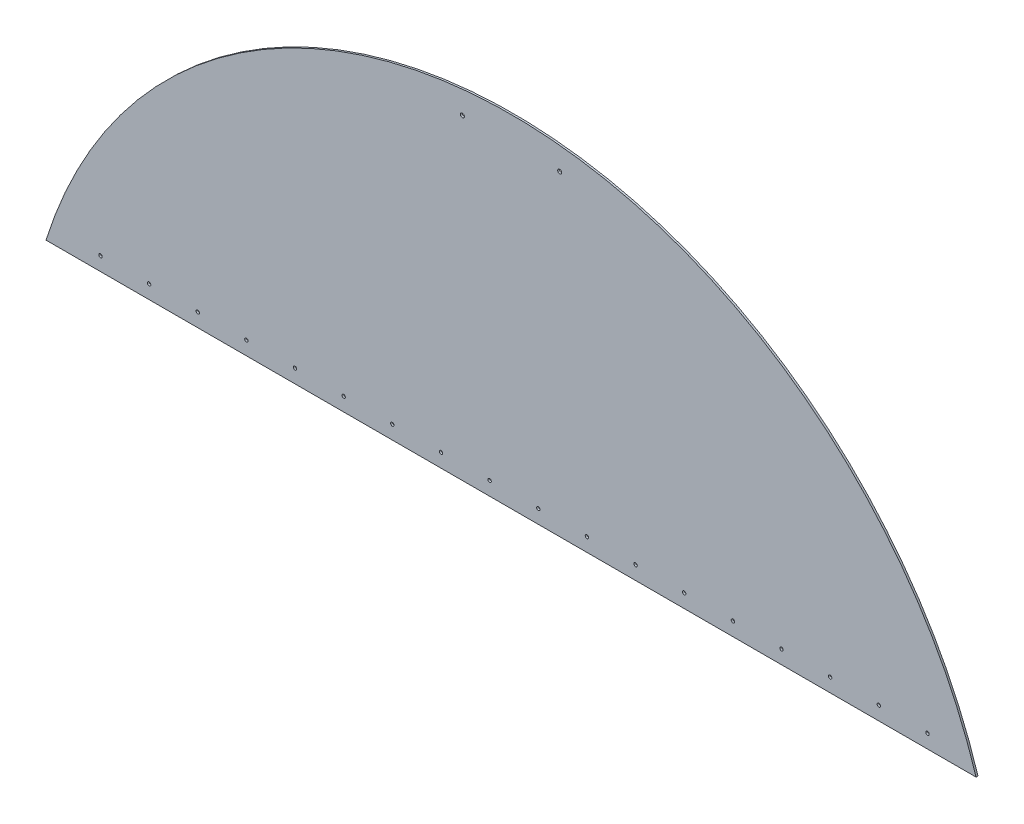
ISO-10303-21;
HEADER;
FILE_DESCRIPTION(('STEP AP214'),'2;1');
FILE_NAME('part.step','',(''),(''),'','','');
FILE_SCHEMA(('AUTOMOTIVE_DESIGN { 1 0 10303 214 1 1 1 1 }'));
ENDSEC;
DATA;
#1=APPLICATION_CONTEXT('core data for automotive mechanical design processes');
#2=APPLICATION_PROTOCOL_DEFINITION('international standard','automotive_design',2000,#1);
#3=PRODUCT_CONTEXT('',#1,'mechanical');
#4=PRODUCT('Part','Part','',(#3));
#5=PRODUCT_RELATED_PRODUCT_CATEGORY('part','',(#4));
#6=PRODUCT_DEFINITION_FORMATION('','',#4);
#7=PRODUCT_DEFINITION_CONTEXT('part definition',#1,'design');
#8=PRODUCT_DEFINITION('design','',#6,#7);
#9=PRODUCT_DEFINITION_SHAPE('','',#8);
#10=(LENGTH_UNIT() NAMED_UNIT(*) SI_UNIT(.MILLI.,.METRE.));
#11=(NAMED_UNIT(*) PLANE_ANGLE_UNIT() SI_UNIT($,.RADIAN.));
#12=(NAMED_UNIT(*) SI_UNIT($,.STERADIAN.) SOLID_ANGLE_UNIT());
#13=UNCERTAINTY_MEASURE_WITH_UNIT(LENGTH_MEASURE(1.E-05),#10,'distance_accuracy_value','');
#14=(GEOMETRIC_REPRESENTATION_CONTEXT(3) GLOBAL_UNCERTAINTY_ASSIGNED_CONTEXT((#13)) GLOBAL_UNIT_ASSIGNED_CONTEXT((#10,
#11,#12)) REPRESENTATION_CONTEXT('',''));
#15=CARTESIAN_POINT('',(0.,0.,0.));
#16=DIRECTION('',(0.,0.,1.));
#17=DIRECTION('',(1.,0.,0.));
#18=AXIS2_PLACEMENT_3D('',#15,#16,#17);
#19=CARTESIAN_POINT('',(0.,0.,1.98374));
#20=DIRECTION('',(0.,0.,-1.));
#21=DIRECTION('',(-1.,0.,0.));
#22=AXIS2_PLACEMENT_3D('',#19,#20,#21);
#23=CYLINDRICAL_SURFACE('',#22,508.9906);
#24=CARTESIAN_POINT('',(0.,0.,0.));
#25=DIRECTION('',(0.,0.,1.));
#26=DIRECTION('',(1.,0.,0.));
#27=AXIS2_PLACEMENT_3D('',#24,#25,#26);
#28=CIRCLE('',#27,508.9906);
#29=CARTESIAN_POINT('',(485.639445358756,152.4,0.));
#30=VERTEX_POINT('',#29);
#31=CARTESIAN_POINT('',(-485.639445358756,152.4,0.));
#32=VERTEX_POINT('',#31);
#33=EDGE_CURVE('E65',#30,#32,#28,.T.);
#34=ORIENTED_EDGE('',*,*,#33,.T.);
#35=DIRECTION('',(0.,0.,-1.));
#36=VECTOR('',#35,1.);
#37=CARTESIAN_POINT('',(-485.639445358756,152.4,1.98374));
#38=LINE('',#37,#36);
#39=CARTESIAN_POINT('',(-485.639445358756,152.4,1.98374));
#40=VERTEX_POINT('',#39);
#41=EDGE_CURVE('E11',#40,#32,#38,.T.);
#42=ORIENTED_EDGE('',*,*,#41,.F.);
#43=CARTESIAN_POINT('',(0.,0.,1.98374));
#44=DIRECTION('',(0.,0.,1.));
#45=DIRECTION('',(1.,0.,0.));
#46=AXIS2_PLACEMENT_3D('',#43,#44,#45);
#47=CIRCLE('',#46,508.9906);
#48=CARTESIAN_POINT('',(485.639445358756,152.4,1.98374));
#49=VERTEX_POINT('',#48);
#50=EDGE_CURVE('E64',#49,#40,#47,.T.);
#51=ORIENTED_EDGE('',*,*,#50,.F.);
#52=DIRECTION('',(0.,0.,-1.));
#53=VECTOR('',#52,1.);
#54=CARTESIAN_POINT('',(485.639445358756,152.4,1.98374));
#55=LINE('',#54,#53);
#56=EDGE_CURVE('E41',#49,#30,#55,.T.);
#57=ORIENTED_EDGE('',*,*,#56,.T.);
#58=EDGE_LOOP('',(#34,#42,#51,#57));
#59=FACE_BOUND('',#58,.T.);
#60=ADVANCED_FACE('F32',(#59),#23,.T.);
#61=CARTESIAN_POINT('',(-485.639445358756,152.4,1.98374));
#62=DIRECTION('',(0.,1.,0.));
#63=DIRECTION('',(0.,0.,1.));
#64=AXIS2_PLACEMENT_3D('',#61,#62,#63);
#65=PLANE('',#64);
#66=DIRECTION('',(1.,0.,0.));
#67=VECTOR('',#66,1.);
#68=CARTESIAN_POINT('',(-485.639445358756,152.4,0.));
#69=LINE('',#68,#67);
#70=EDGE_CURVE('E57',#32,#30,#69,.T.);
#71=ORIENTED_EDGE('',*,*,#70,.T.);
#72=ORIENTED_EDGE('',*,*,#56,.F.);
#73=DIRECTION('',(1.,0.,0.));
#74=VECTOR('',#73,1.);
#75=CARTESIAN_POINT('',(-485.639445358756,152.4,1.98374));
#76=LINE('',#75,#74);
#77=EDGE_CURVE('E49',#40,#49,#76,.T.);
#78=ORIENTED_EDGE('',*,*,#77,.F.);
#79=ORIENTED_EDGE('',*,*,#41,.T.);
#80=EDGE_LOOP('',(#71,#72,#78,#79));
#81=FACE_BOUND('',#80,.T.);
#82=ADVANCED_FACE('F60',(#81),#65,.F.);
#83=CARTESIAN_POINT('',(0.,0.,1.98374));
#84=DIRECTION('',(0.,0.,1.));
#85=DIRECTION('',(1.,0.,0.));
#86=AXIS2_PLACEMENT_3D('',#83,#84,#85);
#87=PLANE('',#86);
#88=CARTESIAN_POINT('',(50.7999999999999,482.6,1.98374));
#89=DIRECTION('',(0.,0.,1.));
#90=DIRECTION('',(1.,0.,0.));
#91=AXIS2_PLACEMENT_3D('',#88,#89,#90);
#92=CIRCLE('',#91,2.0955);
#93=CARTESIAN_POINT('',(52.8954999999999,482.6,1.98374));
#94=VERTEX_POINT('',#93);
#95=EDGE_CURVE('E419',#94,#94,#92,.T.);
#96=ORIENTED_EDGE('',*,*,#95,.F.);
#97=EDGE_LOOP('',(#96));
#98=FACE_BOUND('',#97,.T.);
#99=CARTESIAN_POINT('',(-50.8000000000001,482.6,1.98374));
#100=DIRECTION('',(0.,0.,1.));
#101=DIRECTION('',(1.,0.,0.));
#102=AXIS2_PLACEMENT_3D('',#99,#100,#101);
#103=CIRCLE('',#102,2.0955);
#104=CARTESIAN_POINT('',(-48.7045000000001,482.6,1.98374));
#105=VERTEX_POINT('',#104);
#106=EDGE_CURVE('E421',#105,#105,#103,.T.);
#107=ORIENTED_EDGE('',*,*,#106,.F.);
#108=EDGE_LOOP('',(#107));
#109=FACE_BOUND('',#108,.T.);
#110=CARTESIAN_POINT('',(-428.760554641244,166.6875,1.98374));
#111=DIRECTION('',(0.,0.,1.));
#112=DIRECTION('',(1.,0.,0.));
#113=AXIS2_PLACEMENT_3D('',#110,#111,#112);
#114=CIRCLE('',#113,1.77799999999998);
#115=CARTESIAN_POINT('',(-426.982554641244,166.6875,1.98374));
#116=VERTEX_POINT('',#115);
#117=EDGE_CURVE('E149',#116,#116,#114,.T.);
#118=ORIENTED_EDGE('',*,*,#117,.F.);
#119=EDGE_LOOP('',(#118));
#120=FACE_BOUND('',#119,.T.);
#121=CARTESIAN_POINT('',(-377.960554641244,166.6875,1.98374));
#122=DIRECTION('',(0.,0.,1.));
#123=DIRECTION('',(1.,0.,0.));
#124=AXIS2_PLACEMENT_3D('',#121,#122,#123);
#125=CIRCLE('',#124,1.77799999999998);
#126=CARTESIAN_POINT('',(-376.182554641244,166.6875,1.98374));
#127=VERTEX_POINT('',#126);
#128=EDGE_CURVE('E139',#127,#127,#125,.T.);
#129=ORIENTED_EDGE('',*,*,#128,.F.);
#130=EDGE_LOOP('',(#129));
#131=FACE_BOUND('',#130,.T.);
#132=CARTESIAN_POINT('',(-327.160554641244,166.6875,1.98374));
#133=DIRECTION('',(0.,0.,1.));
#134=DIRECTION('',(1.,0.,0.));
#135=AXIS2_PLACEMENT_3D('',#132,#133,#134);
#136=CIRCLE('',#135,1.77799999999998);
#137=CARTESIAN_POINT('',(-325.382554641244,166.6875,1.98374));
#138=VERTEX_POINT('',#137);
#139=EDGE_CURVE('E136',#138,#138,#136,.T.);
#140=ORIENTED_EDGE('',*,*,#139,.F.);
#141=EDGE_LOOP('',(#140));
#142=FACE_BOUND('',#141,.T.);
#143=CARTESIAN_POINT('',(-276.360554641244,166.6875,1.98374));
#144=DIRECTION('',(0.,0.,1.));
#145=DIRECTION('',(1.,0.,0.));
#146=AXIS2_PLACEMENT_3D('',#143,#144,#145);
#147=CIRCLE('',#146,1.77799999999998);
#148=CARTESIAN_POINT('',(-274.582554641244,166.6875,1.98374));
#149=VERTEX_POINT('',#148);
#150=EDGE_CURVE('E133',#149,#149,#147,.T.);
#151=ORIENTED_EDGE('',*,*,#150,.F.);
#152=EDGE_LOOP('',(#151));
#153=FACE_BOUND('',#152,.T.);
#154=CARTESIAN_POINT('',(-225.560554641244,166.6875,1.98374));
#155=DIRECTION('',(0.,0.,1.));
#156=DIRECTION('',(1.,0.,0.));
#157=AXIS2_PLACEMENT_3D('',#154,#155,#156);
#158=CIRCLE('',#157,1.77799999999998);
#159=CARTESIAN_POINT('',(-223.782554641244,166.6875,1.98374));
#160=VERTEX_POINT('',#159);
#161=EDGE_CURVE('E129',#160,#160,#158,.T.);
#162=ORIENTED_EDGE('',*,*,#161,.F.);
#163=EDGE_LOOP('',(#162));
#164=FACE_BOUND('',#163,.T.);
#165=CARTESIAN_POINT('',(-174.760554641244,166.6875,1.98374));
#166=DIRECTION('',(0.,0.,1.));
#167=DIRECTION('',(1.,0.,0.));
#168=AXIS2_PLACEMENT_3D('',#165,#166,#167);
#169=CIRCLE('',#168,1.77799999999998);
#170=CARTESIAN_POINT('',(-172.982554641244,166.6875,1.98374));
#171=VERTEX_POINT('',#170);
#172=EDGE_CURVE('E125',#171,#171,#169,.T.);
#173=ORIENTED_EDGE('',*,*,#172,.F.);
#174=EDGE_LOOP('',(#173));
#175=FACE_BOUND('',#174,.T.);
#176=CARTESIAN_POINT('',(-123.960554641244,166.6875,1.98374));
#177=DIRECTION('',(0.,0.,1.));
#178=DIRECTION('',(1.,0.,0.));
#179=AXIS2_PLACEMENT_3D('',#176,#177,#178);
#180=CIRCLE('',#179,1.77799999999998);
#181=CARTESIAN_POINT('',(-122.182554641244,166.6875,1.98374));
#182=VERTEX_POINT('',#181);
#183=EDGE_CURVE('E121',#182,#182,#180,.T.);
#184=ORIENTED_EDGE('',*,*,#183,.F.);
#185=EDGE_LOOP('',(#184));
#186=FACE_BOUND('',#185,.T.);
#187=CARTESIAN_POINT('',(-73.1605546412441,166.6875,1.98374));
#188=DIRECTION('',(0.,0.,1.));
#189=DIRECTION('',(1.,0.,0.));
#190=AXIS2_PLACEMENT_3D('',#187,#188,#189);
#191=CIRCLE('',#190,1.77799999999998);
#192=CARTESIAN_POINT('',(-71.3825546412441,166.6875,1.98374));
#193=VERTEX_POINT('',#192);
#194=EDGE_CURVE('E117',#193,#193,#191,.T.);
#195=ORIENTED_EDGE('',*,*,#194,.F.);
#196=EDGE_LOOP('',(#195));
#197=FACE_BOUND('',#196,.T.);
#198=CARTESIAN_POINT('',(-22.3605546412441,166.6875,1.98374));
#199=DIRECTION('',(0.,0.,1.));
#200=DIRECTION('',(1.,0.,0.));
#201=AXIS2_PLACEMENT_3D('',#198,#199,#200);
#202=CIRCLE('',#201,1.77799999999998);
#203=CARTESIAN_POINT('',(-20.5825546412441,166.6875,1.98374));
#204=VERTEX_POINT('',#203);
#205=EDGE_CURVE('E113',#204,#204,#202,.T.);
#206=ORIENTED_EDGE('',*,*,#205,.F.);
#207=EDGE_LOOP('',(#206));
#208=FACE_BOUND('',#207,.T.);
#209=CARTESIAN_POINT('',(28.4394453587559,166.6875,1.98374));
#210=DIRECTION('',(0.,0.,1.));
#211=DIRECTION('',(1.,0.,0.));
#212=AXIS2_PLACEMENT_3D('',#209,#210,#211);
#213=CIRCLE('',#212,1.77799999999998);
#214=CARTESIAN_POINT('',(30.2174453587559,166.6875,1.98374));
#215=VERTEX_POINT('',#214);
#216=EDGE_CURVE('E109',#215,#215,#213,.T.);
#217=ORIENTED_EDGE('',*,*,#216,.F.);
#218=EDGE_LOOP('',(#217));
#219=FACE_BOUND('',#218,.T.);
#220=CARTESIAN_POINT('',(79.2394453587559,166.6875,1.98374));
#221=DIRECTION('',(0.,0.,1.));
#222=DIRECTION('',(1.,0.,0.));
#223=AXIS2_PLACEMENT_3D('',#220,#221,#222);
#224=CIRCLE('',#223,1.77799999999998);
#225=CARTESIAN_POINT('',(81.0174453587559,166.6875,1.98374));
#226=VERTEX_POINT('',#225);
#227=EDGE_CURVE('E105',#226,#226,#224,.T.);
#228=ORIENTED_EDGE('',*,*,#227,.F.);
#229=EDGE_LOOP('',(#228));
#230=FACE_BOUND('',#229,.T.);
#231=CARTESIAN_POINT('',(130.039445358756,166.6875,1.98374));
#232=DIRECTION('',(0.,0.,1.));
#233=DIRECTION('',(1.,0.,0.));
#234=AXIS2_PLACEMENT_3D('',#231,#232,#233);
#235=CIRCLE('',#234,1.77799999999998);
#236=CARTESIAN_POINT('',(131.817445358756,166.6875,1.98374));
#237=VERTEX_POINT('',#236);
#238=EDGE_CURVE('E101',#237,#237,#235,.T.);
#239=ORIENTED_EDGE('',*,*,#238,.F.);
#240=EDGE_LOOP('',(#239));
#241=FACE_BOUND('',#240,.T.);
#242=CARTESIAN_POINT('',(180.839445358756,166.6875,1.98374));
#243=DIRECTION('',(0.,0.,1.));
#244=DIRECTION('',(1.,0.,0.));
#245=AXIS2_PLACEMENT_3D('',#242,#243,#244);
#246=CIRCLE('',#245,1.77799999999998);
#247=CARTESIAN_POINT('',(182.617445358756,166.6875,1.98374));
#248=VERTEX_POINT('',#247);
#249=EDGE_CURVE('E97',#248,#248,#246,.T.);
#250=ORIENTED_EDGE('',*,*,#249,.F.);
#251=EDGE_LOOP('',(#250));
#252=FACE_BOUND('',#251,.T.);
#253=CARTESIAN_POINT('',(231.639445358756,166.6875,1.98374));
#254=DIRECTION('',(0.,0.,1.));
#255=DIRECTION('',(1.,0.,0.));
#256=AXIS2_PLACEMENT_3D('',#253,#254,#255);
#257=CIRCLE('',#256,1.77799999999998);
#258=CARTESIAN_POINT('',(233.417445358756,166.6875,1.98374));
#259=VERTEX_POINT('',#258);
#260=EDGE_CURVE('E93',#259,#259,#257,.T.);
#261=ORIENTED_EDGE('',*,*,#260,.F.);
#262=EDGE_LOOP('',(#261));
#263=FACE_BOUND('',#262,.T.);
#264=CARTESIAN_POINT('',(282.439445358756,166.6875,1.98374));
#265=DIRECTION('',(0.,0.,1.));
#266=DIRECTION('',(1.,0.,0.));
#267=AXIS2_PLACEMENT_3D('',#264,#265,#266);
#268=CIRCLE('',#267,1.77799999999998);
#269=CARTESIAN_POINT('',(284.217445358756,166.6875,1.98374));
#270=VERTEX_POINT('',#269);
#271=EDGE_CURVE('E89',#270,#270,#268,.T.);
#272=ORIENTED_EDGE('',*,*,#271,.F.);
#273=EDGE_LOOP('',(#272));
#274=FACE_BOUND('',#273,.T.);
#275=CARTESIAN_POINT('',(333.239445358756,166.6875,1.98374));
#276=DIRECTION('',(0.,0.,1.));
#277=DIRECTION('',(1.,0.,0.));
#278=AXIS2_PLACEMENT_3D('',#275,#276,#277);
#279=CIRCLE('',#278,1.77799999999998);
#280=CARTESIAN_POINT('',(335.017445358756,166.6875,1.98374));
#281=VERTEX_POINT('',#280);
#282=EDGE_CURVE('E85',#281,#281,#279,.T.);
#283=ORIENTED_EDGE('',*,*,#282,.F.);
#284=EDGE_LOOP('',(#283));
#285=FACE_BOUND('',#284,.T.);
#286=CARTESIAN_POINT('',(384.039445358756,166.6875,1.98374));
#287=DIRECTION('',(0.,0.,1.));
#288=DIRECTION('',(1.,0.,0.));
#289=AXIS2_PLACEMENT_3D('',#286,#287,#288);
#290=CIRCLE('',#289,1.77799999999998);
#291=CARTESIAN_POINT('',(385.817445358756,166.6875,1.98374));
#292=VERTEX_POINT('',#291);
#293=EDGE_CURVE('E81',#292,#292,#290,.T.);
#294=ORIENTED_EDGE('',*,*,#293,.F.);
#295=EDGE_LOOP('',(#294));
#296=FACE_BOUND('',#295,.T.);
#297=CARTESIAN_POINT('',(434.839445358756,166.6875,1.98374));
#298=DIRECTION('',(0.,0.,1.));
#299=DIRECTION('',(1.,0.,0.));
#300=AXIS2_PLACEMENT_3D('',#297,#298,#299);
#301=CIRCLE('',#300,1.77799999999998);
#302=CARTESIAN_POINT('',(436.617445358756,166.6875,1.98374));
#303=VERTEX_POINT('',#302);
#304=EDGE_CURVE('E73',#303,#303,#301,.T.);
#305=ORIENTED_EDGE('',*,*,#304,.F.);
#306=EDGE_LOOP('',(#305));
#307=FACE_BOUND('',#306,.T.);
#308=ORIENTED_EDGE('',*,*,#50,.T.);
#309=ORIENTED_EDGE('',*,*,#77,.T.);
#310=EDGE_LOOP('',(#308,#309));
#311=FACE_BOUND('',#310,.T.);
#312=ADVANCED_FACE('F182',(#98,#109,#120,#131,#142,#153,#164,#175,#186,#197,#208,#219,#230,#241,
#252,#263,#274,#285,#296,#307,#311),#87,.T.);
#313=CARTESIAN_POINT('',(0.,0.,0.));
#314=DIRECTION('',(0.,0.,1.));
#315=DIRECTION('',(1.,0.,0.));
#316=AXIS2_PLACEMENT_3D('',#313,#314,#315);
#317=PLANE('',#316);
#318=CARTESIAN_POINT('',(50.7999999999999,482.6,0.));
#319=DIRECTION('',(0.,0.,1.));
#320=DIRECTION('',(1.,0.,0.));
#321=AXIS2_PLACEMENT_3D('',#318,#319,#320);
#322=CIRCLE('',#321,2.0955);
#323=CARTESIAN_POINT('',(52.8954999999999,482.6,0.));
#324=VERTEX_POINT('',#323);
#325=EDGE_CURVE('E417',#324,#324,#322,.T.);
#326=ORIENTED_EDGE('',*,*,#325,.T.);
#327=EDGE_LOOP('',(#326));
#328=FACE_BOUND('',#327,.T.);
#329=CARTESIAN_POINT('',(-50.8000000000001,482.6,0.));
#330=DIRECTION('',(0.,0.,1.));
#331=DIRECTION('',(1.,0.,0.));
#332=AXIS2_PLACEMENT_3D('',#329,#330,#331);
#333=CIRCLE('',#332,2.0955);
#334=CARTESIAN_POINT('',(-48.7045000000001,482.6,0.));
#335=VERTEX_POINT('',#334);
#336=EDGE_CURVE('E424',#335,#335,#333,.T.);
#337=ORIENTED_EDGE('',*,*,#336,.T.);
#338=EDGE_LOOP('',(#337));
#339=FACE_BOUND('',#338,.T.);
#340=CARTESIAN_POINT('',(-428.760554641244,166.6875,0.));
#341=DIRECTION('',(0.,0.,1.));
#342=DIRECTION('',(1.,0.,0.));
#343=AXIS2_PLACEMENT_3D('',#340,#341,#342);
#344=CIRCLE('',#343,1.77799999999998);
#345=CARTESIAN_POINT('',(-426.982554641244,166.6875,0.));
#346=VERTEX_POINT('',#345);
#347=EDGE_CURVE('E35',#346,#346,#344,.T.);
#348=ORIENTED_EDGE('',*,*,#347,.T.);
#349=EDGE_LOOP('',(#348));
#350=FACE_BOUND('',#349,.T.);
#351=CARTESIAN_POINT('',(-377.960554641244,166.6875,0.));
#352=DIRECTION('',(0.,0.,1.));
#353=DIRECTION('',(1.,0.,0.));
#354=AXIS2_PLACEMENT_3D('',#351,#352,#353);
#355=CIRCLE('',#354,1.77799999999998);
#356=CARTESIAN_POINT('',(-376.182554641244,166.6875,0.));
#357=VERTEX_POINT('',#356);
#358=EDGE_CURVE('E137',#357,#357,#355,.T.);
#359=ORIENTED_EDGE('',*,*,#358,.T.);
#360=EDGE_LOOP('',(#359));
#361=FACE_BOUND('',#360,.T.);
#362=CARTESIAN_POINT('',(-327.160554641244,166.6875,0.));
#363=DIRECTION('',(0.,0.,1.));
#364=DIRECTION('',(1.,0.,0.));
#365=AXIS2_PLACEMENT_3D('',#362,#363,#364);
#366=CIRCLE('',#365,1.77799999999998);
#367=CARTESIAN_POINT('',(-325.382554641244,166.6875,0.));
#368=VERTEX_POINT('',#367);
#369=EDGE_CURVE('E134',#368,#368,#366,.T.);
#370=ORIENTED_EDGE('',*,*,#369,.T.);
#371=EDGE_LOOP('',(#370));
#372=FACE_BOUND('',#371,.T.);
#373=CARTESIAN_POINT('',(-276.360554641244,166.6875,0.));
#374=DIRECTION('',(0.,0.,1.));
#375=DIRECTION('',(1.,0.,0.));
#376=AXIS2_PLACEMENT_3D('',#373,#374,#375);
#377=CIRCLE('',#376,1.77799999999998);
#378=CARTESIAN_POINT('',(-274.582554641244,166.6875,0.));
#379=VERTEX_POINT('',#378);
#380=EDGE_CURVE('E130',#379,#379,#377,.T.);
#381=ORIENTED_EDGE('',*,*,#380,.T.);
#382=EDGE_LOOP('',(#381));
#383=FACE_BOUND('',#382,.T.);
#384=CARTESIAN_POINT('',(-225.560554641244,166.6875,0.));
#385=DIRECTION('',(0.,0.,1.));
#386=DIRECTION('',(1.,0.,0.));
#387=AXIS2_PLACEMENT_3D('',#384,#385,#386);
#388=CIRCLE('',#387,1.77799999999998);
#389=CARTESIAN_POINT('',(-223.782554641244,166.6875,0.));
#390=VERTEX_POINT('',#389);
#391=EDGE_CURVE('E126',#390,#390,#388,.T.);
#392=ORIENTED_EDGE('',*,*,#391,.T.);
#393=EDGE_LOOP('',(#392));
#394=FACE_BOUND('',#393,.T.);
#395=CARTESIAN_POINT('',(-174.760554641244,166.6875,0.));
#396=DIRECTION('',(0.,0.,1.));
#397=DIRECTION('',(1.,0.,0.));
#398=AXIS2_PLACEMENT_3D('',#395,#396,#397);
#399=CIRCLE('',#398,1.77799999999998);
#400=CARTESIAN_POINT('',(-172.982554641244,166.6875,0.));
#401=VERTEX_POINT('',#400);
#402=EDGE_CURVE('E122',#401,#401,#399,.T.);
#403=ORIENTED_EDGE('',*,*,#402,.T.);
#404=EDGE_LOOP('',(#403));
#405=FACE_BOUND('',#404,.T.);
#406=CARTESIAN_POINT('',(-123.960554641244,166.6875,0.));
#407=DIRECTION('',(0.,0.,1.));
#408=DIRECTION('',(1.,0.,0.));
#409=AXIS2_PLACEMENT_3D('',#406,#407,#408);
#410=CIRCLE('',#409,1.77799999999998);
#411=CARTESIAN_POINT('',(-122.182554641244,166.6875,0.));
#412=VERTEX_POINT('',#411);
#413=EDGE_CURVE('E118',#412,#412,#410,.T.);
#414=ORIENTED_EDGE('',*,*,#413,.T.);
#415=EDGE_LOOP('',(#414));
#416=FACE_BOUND('',#415,.T.);
#417=CARTESIAN_POINT('',(-73.1605546412441,166.6875,0.));
#418=DIRECTION('',(0.,0.,1.));
#419=DIRECTION('',(1.,0.,0.));
#420=AXIS2_PLACEMENT_3D('',#417,#418,#419);
#421=CIRCLE('',#420,1.77799999999998);
#422=CARTESIAN_POINT('',(-71.3825546412441,166.6875,0.));
#423=VERTEX_POINT('',#422);
#424=EDGE_CURVE('E114',#423,#423,#421,.T.);
#425=ORIENTED_EDGE('',*,*,#424,.T.);
#426=EDGE_LOOP('',(#425));
#427=FACE_BOUND('',#426,.T.);
#428=CARTESIAN_POINT('',(-22.3605546412441,166.6875,0.));
#429=DIRECTION('',(0.,0.,1.));
#430=DIRECTION('',(1.,0.,0.));
#431=AXIS2_PLACEMENT_3D('',#428,#429,#430);
#432=CIRCLE('',#431,1.77799999999998);
#433=CARTESIAN_POINT('',(-20.5825546412441,166.6875,0.));
#434=VERTEX_POINT('',#433);
#435=EDGE_CURVE('E110',#434,#434,#432,.T.);
#436=ORIENTED_EDGE('',*,*,#435,.T.);
#437=EDGE_LOOP('',(#436));
#438=FACE_BOUND('',#437,.T.);
#439=CARTESIAN_POINT('',(28.4394453587559,166.6875,0.));
#440=DIRECTION('',(0.,0.,1.));
#441=DIRECTION('',(1.,0.,0.));
#442=AXIS2_PLACEMENT_3D('',#439,#440,#441);
#443=CIRCLE('',#442,1.77799999999998);
#444=CARTESIAN_POINT('',(30.2174453587559,166.6875,0.));
#445=VERTEX_POINT('',#444);
#446=EDGE_CURVE('E106',#445,#445,#443,.T.);
#447=ORIENTED_EDGE('',*,*,#446,.T.);
#448=EDGE_LOOP('',(#447));
#449=FACE_BOUND('',#448,.T.);
#450=CARTESIAN_POINT('',(79.2394453587559,166.6875,0.));
#451=DIRECTION('',(0.,0.,1.));
#452=DIRECTION('',(1.,0.,0.));
#453=AXIS2_PLACEMENT_3D('',#450,#451,#452);
#454=CIRCLE('',#453,1.77799999999998);
#455=CARTESIAN_POINT('',(81.0174453587559,166.6875,0.));
#456=VERTEX_POINT('',#455);
#457=EDGE_CURVE('E102',#456,#456,#454,.T.);
#458=ORIENTED_EDGE('',*,*,#457,.T.);
#459=EDGE_LOOP('',(#458));
#460=FACE_BOUND('',#459,.T.);
#461=CARTESIAN_POINT('',(130.039445358756,166.6875,0.));
#462=DIRECTION('',(0.,0.,1.));
#463=DIRECTION('',(1.,0.,0.));
#464=AXIS2_PLACEMENT_3D('',#461,#462,#463);
#465=CIRCLE('',#464,1.77799999999998);
#466=CARTESIAN_POINT('',(131.817445358756,166.6875,0.));
#467=VERTEX_POINT('',#466);
#468=EDGE_CURVE('E98',#467,#467,#465,.T.);
#469=ORIENTED_EDGE('',*,*,#468,.T.);
#470=EDGE_LOOP('',(#469));
#471=FACE_BOUND('',#470,.T.);
#472=CARTESIAN_POINT('',(180.839445358756,166.6875,0.));
#473=DIRECTION('',(0.,0.,1.));
#474=DIRECTION('',(1.,0.,0.));
#475=AXIS2_PLACEMENT_3D('',#472,#473,#474);
#476=CIRCLE('',#475,1.77799999999998);
#477=CARTESIAN_POINT('',(182.617445358756,166.6875,0.));
#478=VERTEX_POINT('',#477);
#479=EDGE_CURVE('E94',#478,#478,#476,.T.);
#480=ORIENTED_EDGE('',*,*,#479,.T.);
#481=EDGE_LOOP('',(#480));
#482=FACE_BOUND('',#481,.T.);
#483=CARTESIAN_POINT('',(231.639445358756,166.6875,0.));
#484=DIRECTION('',(0.,0.,1.));
#485=DIRECTION('',(1.,0.,0.));
#486=AXIS2_PLACEMENT_3D('',#483,#484,#485);
#487=CIRCLE('',#486,1.77799999999998);
#488=CARTESIAN_POINT('',(233.417445358756,166.6875,0.));
#489=VERTEX_POINT('',#488);
#490=EDGE_CURVE('E90',#489,#489,#487,.T.);
#491=ORIENTED_EDGE('',*,*,#490,.T.);
#492=EDGE_LOOP('',(#491));
#493=FACE_BOUND('',#492,.T.);
#494=CARTESIAN_POINT('',(282.439445358756,166.6875,0.));
#495=DIRECTION('',(0.,0.,1.));
#496=DIRECTION('',(1.,0.,0.));
#497=AXIS2_PLACEMENT_3D('',#494,#495,#496);
#498=CIRCLE('',#497,1.77799999999998);
#499=CARTESIAN_POINT('',(284.217445358756,166.6875,0.));
#500=VERTEX_POINT('',#499);
#501=EDGE_CURVE('E86',#500,#500,#498,.T.);
#502=ORIENTED_EDGE('',*,*,#501,.T.);
#503=EDGE_LOOP('',(#502));
#504=FACE_BOUND('',#503,.T.);
#505=CARTESIAN_POINT('',(333.239445358756,166.6875,0.));
#506=DIRECTION('',(0.,0.,1.));
#507=DIRECTION('',(1.,0.,0.));
#508=AXIS2_PLACEMENT_3D('',#505,#506,#507);
#509=CIRCLE('',#508,1.77799999999998);
#510=CARTESIAN_POINT('',(335.017445358756,166.6875,0.));
#511=VERTEX_POINT('',#510);
#512=EDGE_CURVE('E82',#511,#511,#509,.T.);
#513=ORIENTED_EDGE('',*,*,#512,.T.);
#514=EDGE_LOOP('',(#513));
#515=FACE_BOUND('',#514,.T.);
#516=CARTESIAN_POINT('',(384.039445358756,166.6875,0.));
#517=DIRECTION('',(0.,0.,1.));
#518=DIRECTION('',(1.,0.,0.));
#519=AXIS2_PLACEMENT_3D('',#516,#517,#518);
#520=CIRCLE('',#519,1.77799999999998);
#521=CARTESIAN_POINT('',(385.817445358756,166.6875,0.));
#522=VERTEX_POINT('',#521);
#523=EDGE_CURVE('E78',#522,#522,#520,.T.);
#524=ORIENTED_EDGE('',*,*,#523,.T.);
#525=EDGE_LOOP('',(#524));
#526=FACE_BOUND('',#525,.T.);
#527=CARTESIAN_POINT('',(434.839445358756,166.6875,0.));
#528=DIRECTION('',(0.,0.,1.));
#529=DIRECTION('',(1.,0.,0.));
#530=AXIS2_PLACEMENT_3D('',#527,#528,#529);
#531=CIRCLE('',#530,1.77799999999998);
#532=CARTESIAN_POINT('',(436.617445358756,166.6875,0.));
#533=VERTEX_POINT('',#532);
#534=EDGE_CURVE('E70',#533,#533,#531,.T.);
#535=ORIENTED_EDGE('',*,*,#534,.T.);
#536=EDGE_LOOP('',(#535));
#537=FACE_BOUND('',#536,.T.);
#538=ORIENTED_EDGE('',*,*,#33,.F.);
#539=ORIENTED_EDGE('',*,*,#70,.F.);
#540=EDGE_LOOP('',(#538,#539));
#541=FACE_BOUND('',#540,.T.);
#542=ADVANCED_FACE('F69',(#328,#339,#350,#361,#372,#383,#394,#405,#416,#427,#438,#449,#460,#471,
#482,#493,#504,#515,#526,#537,#541),#317,.F.);
#543=CARTESIAN_POINT('',(434.839445358756,166.6875,-23.41626));
#544=DIRECTION('',(0.,0.,1.));
#545=DIRECTION('',(1.,0.,0.));
#546=AXIS2_PLACEMENT_3D('',#543,#544,#545);
#547=CYLINDRICAL_SURFACE('',#546,1.77799999999998);
#548=ORIENTED_EDGE('',*,*,#304,.T.);
#549=EDGE_LOOP('',(#548));
#550=FACE_BOUND('',#549,.T.);
#551=ORIENTED_EDGE('',*,*,#534,.F.);
#552=EDGE_LOOP('',(#551));
#553=FACE_BOUND('',#552,.T.);
#554=ADVANCED_FACE('F190',(#550,#553),#547,.F.);
#555=CARTESIAN_POINT('',(384.039445358756,166.6875,-23.41626));
#556=DIRECTION('',(0.,0.,1.));
#557=DIRECTION('',(1.,0.,0.));
#558=AXIS2_PLACEMENT_3D('',#555,#556,#557);
#559=CYLINDRICAL_SURFACE('',#558,1.77799999999998);
#560=ORIENTED_EDGE('',*,*,#293,.T.);
#561=EDGE_LOOP('',(#560));
#562=FACE_BOUND('',#561,.T.);
#563=ORIENTED_EDGE('',*,*,#523,.F.);
#564=EDGE_LOOP('',(#563));
#565=FACE_BOUND('',#564,.T.);
#566=ADVANCED_FACE('F213',(#562,#565),#559,.F.);
#567=CARTESIAN_POINT('',(333.239445358756,166.6875,-23.41626));
#568=DIRECTION('',(0.,0.,1.));
#569=DIRECTION('',(1.,0.,0.));
#570=AXIS2_PLACEMENT_3D('',#567,#568,#569);
#571=CYLINDRICAL_SURFACE('',#570,1.77799999999998);
#572=ORIENTED_EDGE('',*,*,#282,.T.);
#573=EDGE_LOOP('',(#572));
#574=FACE_BOUND('',#573,.T.);
#575=ORIENTED_EDGE('',*,*,#512,.F.);
#576=EDGE_LOOP('',(#575));
#577=FACE_BOUND('',#576,.T.);
#578=ADVANCED_FACE('F223',(#574,#577),#571,.F.);
#579=CARTESIAN_POINT('',(282.439445358756,166.6875,-23.41626));
#580=DIRECTION('',(0.,0.,1.));
#581=DIRECTION('',(1.,0.,0.));
#582=AXIS2_PLACEMENT_3D('',#579,#580,#581);
#583=CYLINDRICAL_SURFACE('',#582,1.77799999999998);
#584=ORIENTED_EDGE('',*,*,#271,.T.);
#585=EDGE_LOOP('',(#584));
#586=FACE_BOUND('',#585,.T.);
#587=ORIENTED_EDGE('',*,*,#501,.F.);
#588=EDGE_LOOP('',(#587));
#589=FACE_BOUND('',#588,.T.);
#590=ADVANCED_FACE('F233',(#586,#589),#583,.F.);
#591=CARTESIAN_POINT('',(231.639445358756,166.6875,-23.41626));
#592=DIRECTION('',(0.,0.,1.));
#593=DIRECTION('',(1.,0.,0.));
#594=AXIS2_PLACEMENT_3D('',#591,#592,#593);
#595=CYLINDRICAL_SURFACE('',#594,1.77799999999998);
#596=ORIENTED_EDGE('',*,*,#260,.T.);
#597=EDGE_LOOP('',(#596));
#598=FACE_BOUND('',#597,.T.);
#599=ORIENTED_EDGE('',*,*,#490,.F.);
#600=EDGE_LOOP('',(#599));
#601=FACE_BOUND('',#600,.T.);
#602=ADVANCED_FACE('F243',(#598,#601),#595,.F.);
#603=CARTESIAN_POINT('',(180.839445358756,166.6875,-23.41626));
#604=DIRECTION('',(0.,0.,1.));
#605=DIRECTION('',(1.,0.,0.));
#606=AXIS2_PLACEMENT_3D('',#603,#604,#605);
#607=CYLINDRICAL_SURFACE('',#606,1.77799999999998);
#608=ORIENTED_EDGE('',*,*,#249,.T.);
#609=EDGE_LOOP('',(#608));
#610=FACE_BOUND('',#609,.T.);
#611=ORIENTED_EDGE('',*,*,#479,.F.);
#612=EDGE_LOOP('',(#611));
#613=FACE_BOUND('',#612,.T.);
#614=ADVANCED_FACE('F253',(#610,#613),#607,.F.);
#615=CARTESIAN_POINT('',(130.039445358756,166.6875,-23.41626));
#616=DIRECTION('',(0.,0.,1.));
#617=DIRECTION('',(1.,0.,0.));
#618=AXIS2_PLACEMENT_3D('',#615,#616,#617);
#619=CYLINDRICAL_SURFACE('',#618,1.77799999999998);
#620=ORIENTED_EDGE('',*,*,#238,.T.);
#621=EDGE_LOOP('',(#620));
#622=FACE_BOUND('',#621,.T.);
#623=ORIENTED_EDGE('',*,*,#468,.F.);
#624=EDGE_LOOP('',(#623));
#625=FACE_BOUND('',#624,.T.);
#626=ADVANCED_FACE('F263',(#622,#625),#619,.F.);
#627=CARTESIAN_POINT('',(79.2394453587559,166.6875,-23.41626));
#628=DIRECTION('',(0.,0.,1.));
#629=DIRECTION('',(1.,0.,0.));
#630=AXIS2_PLACEMENT_3D('',#627,#628,#629);
#631=CYLINDRICAL_SURFACE('',#630,1.77799999999998);
#632=ORIENTED_EDGE('',*,*,#227,.T.);
#633=EDGE_LOOP('',(#632));
#634=FACE_BOUND('',#633,.T.);
#635=ORIENTED_EDGE('',*,*,#457,.F.);
#636=EDGE_LOOP('',(#635));
#637=FACE_BOUND('',#636,.T.);
#638=ADVANCED_FACE('F273',(#634,#637),#631,.F.);
#639=CARTESIAN_POINT('',(28.4394453587559,166.6875,-23.41626));
#640=DIRECTION('',(0.,0.,1.));
#641=DIRECTION('',(1.,0.,0.));
#642=AXIS2_PLACEMENT_3D('',#639,#640,#641);
#643=CYLINDRICAL_SURFACE('',#642,1.77799999999998);
#644=ORIENTED_EDGE('',*,*,#216,.T.);
#645=EDGE_LOOP('',(#644));
#646=FACE_BOUND('',#645,.T.);
#647=ORIENTED_EDGE('',*,*,#446,.F.);
#648=EDGE_LOOP('',(#647));
#649=FACE_BOUND('',#648,.T.);
#650=ADVANCED_FACE('F283',(#646,#649),#643,.F.);
#651=CARTESIAN_POINT('',(-22.3605546412441,166.6875,-23.41626));
#652=DIRECTION('',(0.,0.,1.));
#653=DIRECTION('',(1.,0.,0.));
#654=AXIS2_PLACEMENT_3D('',#651,#652,#653);
#655=CYLINDRICAL_SURFACE('',#654,1.77799999999998);
#656=ORIENTED_EDGE('',*,*,#205,.T.);
#657=EDGE_LOOP('',(#656));
#658=FACE_BOUND('',#657,.T.);
#659=ORIENTED_EDGE('',*,*,#435,.F.);
#660=EDGE_LOOP('',(#659));
#661=FACE_BOUND('',#660,.T.);
#662=ADVANCED_FACE('F293',(#658,#661),#655,.F.);
#663=CARTESIAN_POINT('',(-73.1605546412441,166.6875,-23.41626));
#664=DIRECTION('',(0.,0.,1.));
#665=DIRECTION('',(1.,0.,0.));
#666=AXIS2_PLACEMENT_3D('',#663,#664,#665);
#667=CYLINDRICAL_SURFACE('',#666,1.77799999999998);
#668=ORIENTED_EDGE('',*,*,#194,.T.);
#669=EDGE_LOOP('',(#668));
#670=FACE_BOUND('',#669,.T.);
#671=ORIENTED_EDGE('',*,*,#424,.F.);
#672=EDGE_LOOP('',(#671));
#673=FACE_BOUND('',#672,.T.);
#674=ADVANCED_FACE('F303',(#670,#673),#667,.F.);
#675=CARTESIAN_POINT('',(-123.960554641244,166.6875,-23.41626));
#676=DIRECTION('',(0.,0.,1.));
#677=DIRECTION('',(1.,0.,0.));
#678=AXIS2_PLACEMENT_3D('',#675,#676,#677);
#679=CYLINDRICAL_SURFACE('',#678,1.77799999999998);
#680=ORIENTED_EDGE('',*,*,#183,.T.);
#681=EDGE_LOOP('',(#680));
#682=FACE_BOUND('',#681,.T.);
#683=ORIENTED_EDGE('',*,*,#413,.F.);
#684=EDGE_LOOP('',(#683));
#685=FACE_BOUND('',#684,.T.);
#686=ADVANCED_FACE('F313',(#682,#685),#679,.F.);
#687=CARTESIAN_POINT('',(-174.760554641244,166.6875,-23.41626));
#688=DIRECTION('',(0.,0.,1.));
#689=DIRECTION('',(1.,0.,0.));
#690=AXIS2_PLACEMENT_3D('',#687,#688,#689);
#691=CYLINDRICAL_SURFACE('',#690,1.77799999999998);
#692=ORIENTED_EDGE('',*,*,#172,.T.);
#693=EDGE_LOOP('',(#692));
#694=FACE_BOUND('',#693,.T.);
#695=ORIENTED_EDGE('',*,*,#402,.F.);
#696=EDGE_LOOP('',(#695));
#697=FACE_BOUND('',#696,.T.);
#698=ADVANCED_FACE('F323',(#694,#697),#691,.F.);
#699=CARTESIAN_POINT('',(-225.560554641244,166.6875,-23.41626));
#700=DIRECTION('',(0.,0.,1.));
#701=DIRECTION('',(1.,0.,0.));
#702=AXIS2_PLACEMENT_3D('',#699,#700,#701);
#703=CYLINDRICAL_SURFACE('',#702,1.77799999999998);
#704=ORIENTED_EDGE('',*,*,#161,.T.);
#705=EDGE_LOOP('',(#704));
#706=FACE_BOUND('',#705,.T.);
#707=ORIENTED_EDGE('',*,*,#391,.F.);
#708=EDGE_LOOP('',(#707));
#709=FACE_BOUND('',#708,.T.);
#710=ADVANCED_FACE('F333',(#706,#709),#703,.F.);
#711=CARTESIAN_POINT('',(-276.360554641244,166.6875,-23.41626));
#712=DIRECTION('',(0.,0.,1.));
#713=DIRECTION('',(1.,0.,0.));
#714=AXIS2_PLACEMENT_3D('',#711,#712,#713);
#715=CYLINDRICAL_SURFACE('',#714,1.77799999999998);
#716=ORIENTED_EDGE('',*,*,#150,.T.);
#717=EDGE_LOOP('',(#716));
#718=FACE_BOUND('',#717,.T.);
#719=ORIENTED_EDGE('',*,*,#380,.F.);
#720=EDGE_LOOP('',(#719));
#721=FACE_BOUND('',#720,.T.);
#722=ADVANCED_FACE('F343',(#718,#721),#715,.F.);
#723=CARTESIAN_POINT('',(-327.160554641244,166.6875,-23.41626));
#724=DIRECTION('',(0.,0.,1.));
#725=DIRECTION('',(1.,0.,0.));
#726=AXIS2_PLACEMENT_3D('',#723,#724,#725);
#727=CYLINDRICAL_SURFACE('',#726,1.77799999999998);
#728=ORIENTED_EDGE('',*,*,#139,.T.);
#729=EDGE_LOOP('',(#728));
#730=FACE_BOUND('',#729,.T.);
#731=ORIENTED_EDGE('',*,*,#369,.F.);
#732=EDGE_LOOP('',(#731));
#733=FACE_BOUND('',#732,.T.);
#734=ADVANCED_FACE('F353',(#730,#733),#727,.F.);
#735=CARTESIAN_POINT('',(-377.960554641244,166.6875,-23.41626));
#736=DIRECTION('',(0.,0.,1.));
#737=DIRECTION('',(1.,0.,0.));
#738=AXIS2_PLACEMENT_3D('',#735,#736,#737);
#739=CYLINDRICAL_SURFACE('',#738,1.77799999999998);
#740=ORIENTED_EDGE('',*,*,#128,.T.);
#741=EDGE_LOOP('',(#740));
#742=FACE_BOUND('',#741,.T.);
#743=ORIENTED_EDGE('',*,*,#358,.F.);
#744=EDGE_LOOP('',(#743));
#745=FACE_BOUND('',#744,.T.);
#746=ADVANCED_FACE('F363',(#742,#745),#739,.F.);
#747=CARTESIAN_POINT('',(-428.760554641244,166.6875,-23.41626));
#748=DIRECTION('',(0.,0.,1.));
#749=DIRECTION('',(1.,0.,0.));
#750=AXIS2_PLACEMENT_3D('',#747,#748,#749);
#751=CYLINDRICAL_SURFACE('',#750,1.77799999999998);
#752=ORIENTED_EDGE('',*,*,#117,.T.);
#753=EDGE_LOOP('',(#752));
#754=FACE_BOUND('',#753,.T.);
#755=ORIENTED_EDGE('',*,*,#347,.F.);
#756=EDGE_LOOP('',(#755));
#757=FACE_BOUND('',#756,.T.);
#758=ADVANCED_FACE('F373',(#754,#757),#751,.F.);
#759=CARTESIAN_POINT('',(-50.8000000000001,482.6,0.));
#760=DIRECTION('',(0.,0.,1.));
#761=DIRECTION('',(1.,0.,0.));
#762=AXIS2_PLACEMENT_3D('',#759,#760,#761);
#763=CYLINDRICAL_SURFACE('',#762,2.0955);
#764=ORIENTED_EDGE('',*,*,#336,.F.);
#765=EDGE_LOOP('',(#764));
#766=FACE_BOUND('',#765,.T.);
#767=ORIENTED_EDGE('',*,*,#106,.T.);
#768=EDGE_LOOP('',(#767));
#769=FACE_BOUND('',#768,.T.);
#770=ADVANCED_FACE('F381',(#766,#769),#763,.F.);
#771=CARTESIAN_POINT('',(50.7999999999999,482.6,0.));
#772=DIRECTION('',(0.,0.,1.));
#773=DIRECTION('',(1.,0.,0.));
#774=AXIS2_PLACEMENT_3D('',#771,#772,#773);
#775=CYLINDRICAL_SURFACE('',#774,2.0955);
#776=ORIENTED_EDGE('',*,*,#325,.F.);
#777=EDGE_LOOP('',(#776));
#778=FACE_BOUND('',#777,.T.);
#779=ORIENTED_EDGE('',*,*,#95,.T.);
#780=EDGE_LOOP('',(#779));
#781=FACE_BOUND('',#780,.T.);
#782=ADVANCED_FACE('F400',(#778,#781),#775,.F.);
#783=CLOSED_SHELL('',(#60,#82,#312,#542,#554,#566,#578,#590,#602,#614,#626,#638,#650,#662,#674,
#686,#698,#710,#722,#734,#746,#758,#770,#782));
#784=MANIFOLD_SOLID_BREP('B2',#783);
#785=ADVANCED_BREP_SHAPE_REPRESENTATION('',(#18,#784),#14);
#786=SHAPE_DEFINITION_REPRESENTATION(#9,#785);
ENDSEC;
END-ISO-10303-21;
